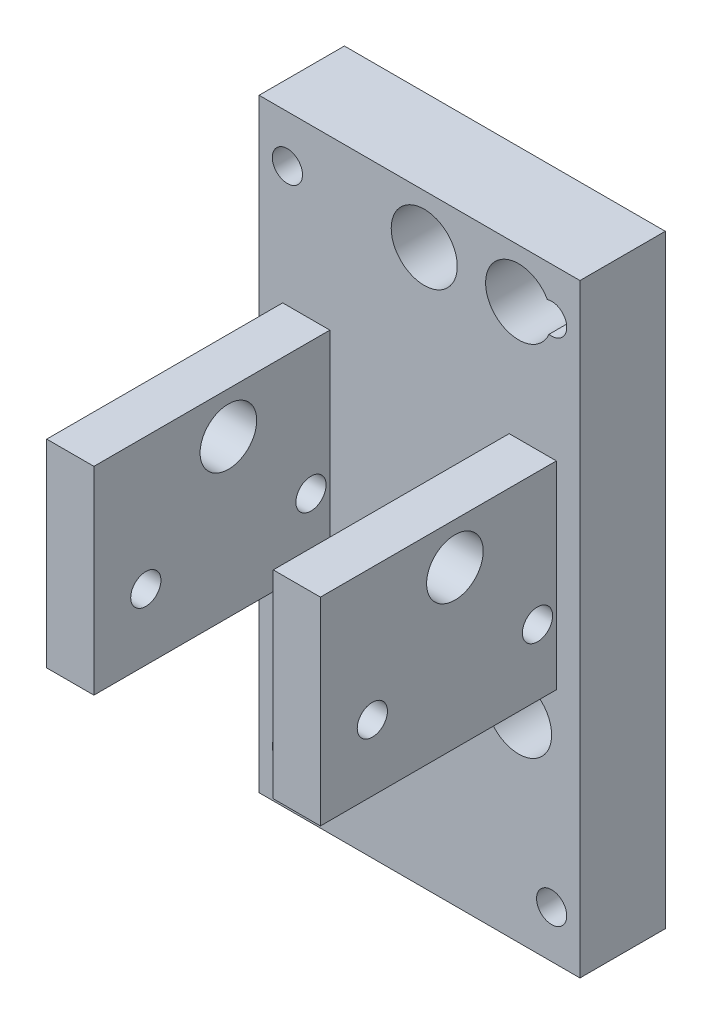
ISO-10303-21;
HEADER;
FILE_DESCRIPTION(('STEP AP214'),'2;1');
FILE_NAME('part.step','',(''),(''),'','','');
FILE_SCHEMA(('AUTOMOTIVE_DESIGN { 1 0 10303 214 1 1 1 1 }'));
ENDSEC;
DATA;
#1=APPLICATION_CONTEXT('core data for automotive mechanical design processes');
#2=APPLICATION_PROTOCOL_DEFINITION('international standard','automotive_design',2000,#1);
#3=PRODUCT_CONTEXT('',#1,'mechanical');
#4=PRODUCT('Part','Part','',(#3));
#5=PRODUCT_RELATED_PRODUCT_CATEGORY('part','',(#4));
#6=PRODUCT_DEFINITION_FORMATION('','',#4);
#7=PRODUCT_DEFINITION_CONTEXT('part definition',#1,'design');
#8=PRODUCT_DEFINITION('design','',#6,#7);
#9=PRODUCT_DEFINITION_SHAPE('','',#8);
#10=(LENGTH_UNIT() NAMED_UNIT(*) SI_UNIT(.MILLI.,.METRE.));
#11=(NAMED_UNIT(*) PLANE_ANGLE_UNIT() SI_UNIT($,.RADIAN.));
#12=(NAMED_UNIT(*) SI_UNIT($,.STERADIAN.) SOLID_ANGLE_UNIT());
#13=UNCERTAINTY_MEASURE_WITH_UNIT(LENGTH_MEASURE(1.E-05),#10,'distance_accuracy_value','');
#14=(GEOMETRIC_REPRESENTATION_CONTEXT(3) GLOBAL_UNCERTAINTY_ASSIGNED_CONTEXT((#13)) GLOBAL_UNIT_ASSIGNED_CONTEXT((#10,
#11,#12)) REPRESENTATION_CONTEXT('',''));
#15=CARTESIAN_POINT('',(0.,0.,0.));
#16=DIRECTION('',(0.,0.,1.));
#17=DIRECTION('',(1.,0.,0.));
#18=AXIS2_PLACEMENT_3D('',#15,#16,#17);
#19=CARTESIAN_POINT('',(0.,0.,9.04));
#20=DIRECTION('',(0.,0.,-1.));
#21=DIRECTION('',(-1.,0.,0.));
#22=AXIS2_PLACEMENT_3D('',#19,#20,#21);
#23=PLANE('',#22);
#24=CARTESIAN_POINT('',(0.499999999999997,-11.2,9.04));
#25=DIRECTION('',(0.,0.,-1.));
#26=DIRECTION('',(-1.,0.,0.));
#27=AXIS2_PLACEMENT_3D('',#24,#25,#26);
#28=CIRCLE('',#27,3.5);
#29=CARTESIAN_POINT('',(-3.,-11.2,9.04));
#30=VERTEX_POINT('',#29);
#31=EDGE_CURVE('E531',#30,#30,#28,.T.);
#32=ORIENTED_EDGE('',*,*,#31,.T.);
#33=EDGE_LOOP('',(#32));
#34=FACE_BOUND('',#33,.T.);
#35=CARTESIAN_POINT('',(10.5,-11.2,9.04));
#36=DIRECTION('',(0.,0.,-1.));
#37=DIRECTION('',(-1.,0.,0.));
#38=AXIS2_PLACEMENT_3D('',#35,#36,#37);
#39=CIRCLE('',#38,3.5);
#40=CARTESIAN_POINT('',(7.,-11.2,9.04));
#41=VERTEX_POINT('',#40);
#42=EDGE_CURVE('E533',#41,#41,#39,.T.);
#43=ORIENTED_EDGE('',*,*,#42,.T.);
#44=EDGE_LOOP('',(#43));
#45=FACE_BOUND('',#44,.T.);
#46=CARTESIAN_POINT('',(0.499999999999997,26.8,9.04));
#47=DIRECTION('',(0.,0.,-1.));
#48=DIRECTION('',(-1.,0.,0.));
#49=AXIS2_PLACEMENT_3D('',#46,#47,#48);
#50=CIRCLE('',#49,3.5);
#51=CARTESIAN_POINT('',(-3.,26.8,9.04));
#52=VERTEX_POINT('',#51);
#53=EDGE_CURVE('E538',#52,#52,#50,.T.);
#54=ORIENTED_EDGE('',*,*,#53,.T.);
#55=EDGE_LOOP('',(#54));
#56=FACE_BOUND('',#55,.T.);
#57=CARTESIAN_POINT('',(-14.,27.,9.04));
#58=DIRECTION('',(0.,0.,1.));
#59=DIRECTION('',(-1.,0.,0.));
#60=AXIS2_PLACEMENT_3D('',#57,#58,#59);
#61=CIRCLE('',#60,1.6);
#62=CARTESIAN_POINT('',(-15.6,27.,9.04));
#63=VERTEX_POINT('',#62);
#64=EDGE_CURVE('E542',#63,#63,#61,.T.);
#65=ORIENTED_EDGE('',*,*,#64,.F.);
#66=EDGE_LOOP('',(#65));
#67=FACE_BOUND('',#66,.T.);
#68=CARTESIAN_POINT('',(14.,-27.,9.04));
#69=DIRECTION('',(0.,0.,1.));
#70=DIRECTION('',(-1.,0.,0.));
#71=AXIS2_PLACEMENT_3D('',#68,#69,#70);
#72=CIRCLE('',#71,1.6);
#73=CARTESIAN_POINT('',(12.4,-27.,9.04));
#74=VERTEX_POINT('',#73);
#75=EDGE_CURVE('E535',#74,#74,#72,.T.);
#76=ORIENTED_EDGE('',*,*,#75,.F.);
#77=EDGE_LOOP('',(#76));
#78=FACE_BOUND('',#77,.T.);
#79=CARTESIAN_POINT('',(14.,27.,9.04));
#80=DIRECTION('',(0.,0.,1.));
#81=DIRECTION('',(1.,0.,0.));
#82=AXIS2_PLACEMENT_3D('',#79,#80,#81);
#83=CIRCLE('',#82,1.6);
#84=CARTESIAN_POINT('',(13.7185745984634,25.4249445268912,9.04));
#85=VERTEX_POINT('',#84);
#86=CARTESIAN_POINT('',(13.5409860199256,28.5327446513024,9.04));
#87=VERTEX_POINT('',#86);
#88=EDGE_CURVE('E532',#85,#87,#83,.T.);
#89=ORIENTED_EDGE('',*,*,#88,.F.);
#90=CARTESIAN_POINT('',(10.5,26.8,9.04));
#91=DIRECTION('',(0.,0.,-1.));
#92=DIRECTION('',(-1.,0.,0.));
#93=AXIS2_PLACEMENT_3D('',#90,#91,#92);
#94=CIRCLE('',#93,3.5);
#95=EDGE_CURVE('E132',#85,#87,#94,.T.);
#96=ORIENTED_EDGE('',*,*,#95,.T.);
#97=EDGE_LOOP('',(#89,#96));
#98=FACE_BOUND('',#97,.T.);
#99=CARTESIAN_POINT('',(-14.,-27.,9.04));
#100=DIRECTION('',(0.,0.,1.));
#101=DIRECTION('',(1.,0.,0.));
#102=AXIS2_PLACEMENT_3D('',#99,#100,#101);
#103=CIRCLE('',#102,1.6);
#104=CARTESIAN_POINT('',(-12.4,-27.,9.04));
#105=VERTEX_POINT('',#104);
#106=EDGE_CURVE('E153',#105,#105,#103,.T.);
#107=ORIENTED_EDGE('',*,*,#106,.F.);
#108=EDGE_LOOP('',(#107));
#109=FACE_BOUND('',#108,.T.);
#110=DIRECTION('',(1.,0.,0.));
#111=VECTOR('',#110,1.);
#112=CARTESIAN_POINT('',(14.5,-6.8,9.04));
#113=LINE('',#112,#111);
#114=CARTESIAN_POINT('',(9.5,-6.8,9.04));
#115=VERTEX_POINT('',#114);
#116=CARTESIAN_POINT('',(14.5,-6.8,9.04));
#117=VERTEX_POINT('',#116);
#118=EDGE_CURVE('E229',#115,#117,#113,.T.);
#119=ORIENTED_EDGE('',*,*,#118,.F.);
#120=DIRECTION('',(0.,-1.,0.));
#121=VECTOR('',#120,1.);
#122=CARTESIAN_POINT('',(9.5,14.2,9.04));
#123=LINE('',#122,#121);
#124=CARTESIAN_POINT('',(9.5,14.2,9.04));
#125=VERTEX_POINT('',#124);
#126=EDGE_CURVE('E234',#125,#115,#123,.T.);
#127=ORIENTED_EDGE('',*,*,#126,.F.);
#128=DIRECTION('',(-1.,0.,0.));
#129=VECTOR('',#128,1.);
#130=CARTESIAN_POINT('',(9.5,14.2,9.04));
#131=LINE('',#130,#129);
#132=CARTESIAN_POINT('',(14.5,14.2,9.04));
#133=VERTEX_POINT('',#132);
#134=EDGE_CURVE('E246',#133,#125,#131,.T.);
#135=ORIENTED_EDGE('',*,*,#134,.F.);
#136=DIRECTION('',(0.,1.,0.));
#137=VECTOR('',#136,1.);
#138=CARTESIAN_POINT('',(14.5,14.2,9.04));
#139=LINE('',#138,#137);
#140=EDGE_CURVE('E243',#117,#133,#139,.T.);
#141=ORIENTED_EDGE('',*,*,#140,.F.);
#142=EDGE_LOOP('',(#119,#127,#135,#141));
#143=FACE_BOUND('',#142,.T.);
#144=DIRECTION('',(0.,1.,0.));
#145=VECTOR('',#144,1.);
#146=CARTESIAN_POINT('',(17.,-32.,9.04));
#147=LINE('',#146,#145);
#148=CARTESIAN_POINT('',(17.,-32.,9.04));
#149=VERTEX_POINT('',#148);
#150=CARTESIAN_POINT('',(17.,32.,9.04));
#151=VERTEX_POINT('',#150);
#152=EDGE_CURVE('E263',#149,#151,#147,.T.);
#153=ORIENTED_EDGE('',*,*,#152,.T.);
#154=DIRECTION('',(-1.,0.,0.));
#155=VECTOR('',#154,1.);
#156=CARTESIAN_POINT('',(-17.,32.,9.04));
#157=LINE('',#156,#155);
#158=CARTESIAN_POINT('',(-17.,32.,9.04));
#159=VERTEX_POINT('',#158);
#160=EDGE_CURVE('E266',#151,#159,#157,.T.);
#161=ORIENTED_EDGE('',*,*,#160,.T.);
#162=DIRECTION('',(0.,-1.,0.));
#163=VECTOR('',#162,1.);
#164=CARTESIAN_POINT('',(-17.,-32.,9.04));
#165=LINE('',#164,#163);
#166=CARTESIAN_POINT('',(-17.,-32.,9.04));
#167=VERTEX_POINT('',#166);
#168=EDGE_CURVE('E269',#159,#167,#165,.T.);
#169=ORIENTED_EDGE('',*,*,#168,.T.);
#170=DIRECTION('',(1.,0.,0.));
#171=VECTOR('',#170,1.);
#172=CARTESIAN_POINT('',(-17.,-32.,9.04));
#173=LINE('',#172,#171);
#174=EDGE_CURVE('E271',#167,#149,#173,.T.);
#175=ORIENTED_EDGE('',*,*,#174,.T.);
#176=EDGE_LOOP('',(#153,#161,#169,#175));
#177=FACE_BOUND('',#176,.T.);
#178=DIRECTION('',(0.,1.,0.));
#179=VECTOR('',#178,1.);
#180=CARTESIAN_POINT('',(-9.5,14.2,9.04));
#181=LINE('',#180,#179);
#182=CARTESIAN_POINT('',(-9.50000000000001,-6.8,9.04));
#183=VERTEX_POINT('',#182);
#184=CARTESIAN_POINT('',(-9.5,14.2,9.04));
#185=VERTEX_POINT('',#184);
#186=EDGE_CURVE('E199',#183,#185,#181,.T.);
#187=ORIENTED_EDGE('',*,*,#186,.F.);
#188=DIRECTION('',(1.,0.,0.));
#189=VECTOR('',#188,1.);
#190=CARTESIAN_POINT('',(-14.5,-6.8,9.04));
#191=LINE('',#190,#189);
#192=CARTESIAN_POINT('',(-14.5,-6.8,9.04));
#193=VERTEX_POINT('',#192);
#194=EDGE_CURVE('E204',#193,#183,#191,.T.);
#195=ORIENTED_EDGE('',*,*,#194,.F.);
#196=DIRECTION('',(0.,-1.,0.));
#197=VECTOR('',#196,1.);
#198=CARTESIAN_POINT('',(-14.5,14.2,9.04));
#199=LINE('',#198,#197);
#200=CARTESIAN_POINT('',(-14.5,14.2,9.04));
#201=VERTEX_POINT('',#200);
#202=EDGE_CURVE('E214',#201,#193,#199,.T.);
#203=ORIENTED_EDGE('',*,*,#202,.F.);
#204=DIRECTION('',(-1.,0.,0.));
#205=VECTOR('',#204,1.);
#206=CARTESIAN_POINT('',(-9.5,14.2,9.04));
#207=LINE('',#206,#205);
#208=EDGE_CURVE('E55',#185,#201,#207,.T.);
#209=ORIENTED_EDGE('',*,*,#208,.F.);
#210=EDGE_LOOP('',(#187,#195,#203,#209));
#211=FACE_BOUND('',#210,.T.);
#212=ADVANCED_FACE('F32',(#34,#45,#56,#67,#78,#98,#109,#143,#177,#211),#23,.F.);
#213=CARTESIAN_POINT('',(17.,-32.,9.04));
#214=DIRECTION('',(-1.,0.,0.));
#215=DIRECTION('',(0.,0.,1.));
#216=AXIS2_PLACEMENT_3D('',#213,#214,#215);
#217=PLANE('',#216);
#218=DIRECTION('',(0.,1.,0.));
#219=VECTOR('',#218,1.);
#220=CARTESIAN_POINT('',(17.,-32.,0.));
#221=LINE('',#220,#219);
#222=CARTESIAN_POINT('',(17.,-32.,0.));
#223=VERTEX_POINT('',#222);
#224=CARTESIAN_POINT('',(17.,32.,0.));
#225=VERTEX_POINT('',#224);
#226=EDGE_CURVE('E262',#223,#225,#221,.T.);
#227=ORIENTED_EDGE('',*,*,#226,.T.);
#228=DIRECTION('',(0.,0.,-1.));
#229=VECTOR('',#228,1.);
#230=CARTESIAN_POINT('',(17.,32.,9.04));
#231=LINE('',#230,#229);
#232=EDGE_CURVE('E159',#151,#225,#231,.T.);
#233=ORIENTED_EDGE('',*,*,#232,.F.);
#234=ORIENTED_EDGE('',*,*,#152,.F.);
#235=DIRECTION('',(0.,0.,-1.));
#236=VECTOR('',#235,1.);
#237=CARTESIAN_POINT('',(17.,-32.,9.04));
#238=LINE('',#237,#236);
#239=EDGE_CURVE('E273',#149,#223,#238,.T.);
#240=ORIENTED_EDGE('',*,*,#239,.T.);
#241=EDGE_LOOP('',(#227,#233,#234,#240));
#242=FACE_BOUND('',#241,.T.);
#243=ADVANCED_FACE('F34',(#242),#217,.F.);
#244=CARTESIAN_POINT('',(-17.,32.,9.04));
#245=DIRECTION('',(0.,-1.,0.));
#246=DIRECTION('',(0.,0.,-1.));
#247=AXIS2_PLACEMENT_3D('',#244,#245,#246);
#248=PLANE('',#247);
#249=DIRECTION('',(-1.,0.,0.));
#250=VECTOR('',#249,1.);
#251=CARTESIAN_POINT('',(-17.,32.,0.));
#252=LINE('',#251,#250);
#253=CARTESIAN_POINT('',(-17.,32.,0.));
#254=VERTEX_POINT('',#253);
#255=EDGE_CURVE('E275',#225,#254,#252,.T.);
#256=ORIENTED_EDGE('',*,*,#255,.T.);
#257=DIRECTION('',(0.,0.,-1.));
#258=VECTOR('',#257,1.);
#259=CARTESIAN_POINT('',(-17.,32.,9.04));
#260=LINE('',#259,#258);
#261=EDGE_CURVE('E161',#159,#254,#260,.T.);
#262=ORIENTED_EDGE('',*,*,#261,.F.);
#263=ORIENTED_EDGE('',*,*,#160,.F.);
#264=ORIENTED_EDGE('',*,*,#232,.T.);
#265=EDGE_LOOP('',(#256,#262,#263,#264));
#266=FACE_BOUND('',#265,.T.);
#267=ADVANCED_FACE('F298',(#266),#248,.F.);
#268=CARTESIAN_POINT('',(-17.,-32.,9.04));
#269=DIRECTION('',(1.,0.,0.));
#270=DIRECTION('',(0.,0.,-1.));
#271=AXIS2_PLACEMENT_3D('',#268,#269,#270);
#272=PLANE('',#271);
#273=DIRECTION('',(0.,-1.,0.));
#274=VECTOR('',#273,1.);
#275=CARTESIAN_POINT('',(-17.,-32.,0.));
#276=LINE('',#275,#274);
#277=CARTESIAN_POINT('',(-17.,-32.,0.));
#278=VERTEX_POINT('',#277);
#279=EDGE_CURVE('E277',#254,#278,#276,.T.);
#280=ORIENTED_EDGE('',*,*,#279,.T.);
#281=DIRECTION('',(0.,0.,-1.));
#282=VECTOR('',#281,1.);
#283=CARTESIAN_POINT('',(-17.,-32.,9.04));
#284=LINE('',#283,#282);
#285=EDGE_CURVE('E167',#167,#278,#284,.T.);
#286=ORIENTED_EDGE('',*,*,#285,.F.);
#287=ORIENTED_EDGE('',*,*,#168,.F.);
#288=ORIENTED_EDGE('',*,*,#261,.T.);
#289=EDGE_LOOP('',(#280,#286,#287,#288));
#290=FACE_BOUND('',#289,.T.);
#291=ADVANCED_FACE('F297',(#290),#272,.F.);
#292=CARTESIAN_POINT('',(-17.,-32.,9.04));
#293=DIRECTION('',(0.,1.,0.));
#294=DIRECTION('',(0.,0.,1.));
#295=AXIS2_PLACEMENT_3D('',#292,#293,#294);
#296=PLANE('',#295);
#297=DIRECTION('',(1.,0.,0.));
#298=VECTOR('',#297,1.);
#299=CARTESIAN_POINT('',(-17.,-32.,0.));
#300=LINE('',#299,#298);
#301=EDGE_CURVE('E267',#278,#223,#300,.T.);
#302=ORIENTED_EDGE('',*,*,#301,.T.);
#303=ORIENTED_EDGE('',*,*,#239,.F.);
#304=ORIENTED_EDGE('',*,*,#174,.F.);
#305=ORIENTED_EDGE('',*,*,#285,.T.);
#306=EDGE_LOOP('',(#302,#303,#304,#305));
#307=FACE_BOUND('',#306,.T.);
#308=ADVANCED_FACE('F286',(#307),#296,.F.);
#309=CARTESIAN_POINT('',(0.,0.,0.));
#310=DIRECTION('',(0.,0.,-1.));
#311=DIRECTION('',(-1.,0.,0.));
#312=AXIS2_PLACEMENT_3D('',#309,#310,#311);
#313=PLANE('',#312);
#314=CARTESIAN_POINT('',(10.5,26.8,0.));
#315=DIRECTION('',(0.,0.,-1.));
#316=DIRECTION('',(1.,0.,0.));
#317=AXIS2_PLACEMENT_3D('',#314,#315,#316);
#318=CIRCLE('',#317,3.5);
#319=CARTESIAN_POINT('',(13.7185745984634,25.4249445268912,0.));
#320=VERTEX_POINT('',#319);
#321=CARTESIAN_POINT('',(13.5409860199256,28.5327446513024,0.));
#322=VERTEX_POINT('',#321);
#323=EDGE_CURVE('E47',#320,#322,#318,.T.);
#324=ORIENTED_EDGE('',*,*,#323,.F.);
#325=CARTESIAN_POINT('',(14.,27.,0.));
#326=DIRECTION('',(0.,0.,-1.));
#327=DIRECTION('',(-1.,0.,0.));
#328=AXIS2_PLACEMENT_3D('',#325,#326,#327);
#329=CIRCLE('',#328,1.6);
#330=EDGE_CURVE('E141',#322,#320,#329,.T.);
#331=ORIENTED_EDGE('',*,*,#330,.F.);
#332=EDGE_LOOP('',(#324,#331));
#333=FACE_BOUND('',#332,.T.);
#334=CARTESIAN_POINT('',(0.499999999999997,-11.2,0.));
#335=DIRECTION('',(0.,0.,-1.));
#336=DIRECTION('',(1.,0.,0.));
#337=AXIS2_PLACEMENT_3D('',#334,#335,#336);
#338=CIRCLE('',#337,3.5);
#339=CARTESIAN_POINT('',(4.,-11.2,0.));
#340=VERTEX_POINT('',#339);
#341=EDGE_CURVE('E143',#340,#340,#338,.T.);
#342=ORIENTED_EDGE('',*,*,#341,.F.);
#343=EDGE_LOOP('',(#342));
#344=FACE_BOUND('',#343,.T.);
#345=CARTESIAN_POINT('',(10.5,-11.2,0.));
#346=DIRECTION('',(0.,0.,-1.));
#347=DIRECTION('',(-1.,0.,0.));
#348=AXIS2_PLACEMENT_3D('',#345,#346,#347);
#349=CIRCLE('',#348,3.5);
#350=CARTESIAN_POINT('',(7.,-11.2,0.));
#351=VERTEX_POINT('',#350);
#352=EDGE_CURVE('E603',#351,#351,#349,.T.);
#353=ORIENTED_EDGE('',*,*,#352,.F.);
#354=EDGE_LOOP('',(#353));
#355=FACE_BOUND('',#354,.T.);
#356=CARTESIAN_POINT('',(0.499999999999997,26.8,0.));
#357=DIRECTION('',(0.,0.,-1.));
#358=DIRECTION('',(-1.,0.,0.));
#359=AXIS2_PLACEMENT_3D('',#356,#357,#358);
#360=CIRCLE('',#359,3.5);
#361=CARTESIAN_POINT('',(-3.,26.8,0.));
#362=VERTEX_POINT('',#361);
#363=EDGE_CURVE('E142',#362,#362,#360,.T.);
#364=ORIENTED_EDGE('',*,*,#363,.F.);
#365=EDGE_LOOP('',(#364));
#366=FACE_BOUND('',#365,.T.);
#367=CARTESIAN_POINT('',(-14.,27.,0.));
#368=DIRECTION('',(0.,0.,-1.));
#369=DIRECTION('',(-1.,0.,0.));
#370=AXIS2_PLACEMENT_3D('',#367,#368,#369);
#371=CIRCLE('',#370,1.6);
#372=CARTESIAN_POINT('',(-15.6,27.,0.));
#373=VERTEX_POINT('',#372);
#374=EDGE_CURVE('E150',#373,#373,#371,.T.);
#375=ORIENTED_EDGE('',*,*,#374,.F.);
#376=EDGE_LOOP('',(#375));
#377=FACE_BOUND('',#376,.T.);
#378=CARTESIAN_POINT('',(14.,-27.,0.));
#379=DIRECTION('',(0.,0.,-1.));
#380=DIRECTION('',(-1.,0.,0.));
#381=AXIS2_PLACEMENT_3D('',#378,#379,#380);
#382=CIRCLE('',#381,1.6);
#383=CARTESIAN_POINT('',(12.4,-27.,0.));
#384=VERTEX_POINT('',#383);
#385=EDGE_CURVE('E146',#384,#384,#382,.T.);
#386=ORIENTED_EDGE('',*,*,#385,.F.);
#387=EDGE_LOOP('',(#386));
#388=FACE_BOUND('',#387,.T.);
#389=CARTESIAN_POINT('',(-14.,-27.,0.));
#390=DIRECTION('',(0.,0.,-1.));
#391=DIRECTION('',(-1.,0.,0.));
#392=AXIS2_PLACEMENT_3D('',#389,#390,#391);
#393=CIRCLE('',#392,1.6);
#394=CARTESIAN_POINT('',(-15.6,-27.,0.));
#395=VERTEX_POINT('',#394);
#396=EDGE_CURVE('E147',#395,#395,#393,.T.);
#397=ORIENTED_EDGE('',*,*,#396,.F.);
#398=EDGE_LOOP('',(#397));
#399=FACE_BOUND('',#398,.T.);
#400=ORIENTED_EDGE('',*,*,#226,.F.);
#401=ORIENTED_EDGE('',*,*,#301,.F.);
#402=ORIENTED_EDGE('',*,*,#279,.F.);
#403=ORIENTED_EDGE('',*,*,#255,.F.);
#404=EDGE_LOOP('',(#400,#401,#402,#403));
#405=FACE_BOUND('',#404,.T.);
#406=ADVANCED_FACE('F139',(#333,#344,#355,#366,#377,#388,#399,#405),#313,.T.);
#407=CARTESIAN_POINT('',(14.5,-6.8,34.04));
#408=DIRECTION('',(0.,1.,0.));
#409=DIRECTION('',(-1.,0.,0.));
#410=AXIS2_PLACEMENT_3D('',#407,#408,#409);
#411=PLANE('',#410);
#412=ORIENTED_EDGE('',*,*,#118,.T.);
#413=DIRECTION('',(0.,0.,-1.));
#414=VECTOR('',#413,1.);
#415=CARTESIAN_POINT('',(14.5,-6.8,34.04));
#416=LINE('',#415,#414);
#417=CARTESIAN_POINT('',(14.5,-6.8,34.04));
#418=VERTEX_POINT('',#417);
#419=EDGE_CURVE('E259',#418,#117,#416,.T.);
#420=ORIENTED_EDGE('',*,*,#419,.F.);
#421=DIRECTION('',(1.,0.,0.));
#422=VECTOR('',#421,1.);
#423=CARTESIAN_POINT('',(14.5,-6.8,34.04));
#424=LINE('',#423,#422);
#425=CARTESIAN_POINT('',(9.5,-6.8,34.04));
#426=VERTEX_POINT('',#425);
#427=EDGE_CURVE('E230',#426,#418,#424,.T.);
#428=ORIENTED_EDGE('',*,*,#427,.F.);
#429=DIRECTION('',(0.,0.,-1.));
#430=VECTOR('',#429,1.);
#431=CARTESIAN_POINT('',(9.5,-6.8,34.04));
#432=LINE('',#431,#430);
#433=EDGE_CURVE('E240',#426,#115,#432,.T.);
#434=ORIENTED_EDGE('',*,*,#433,.T.);
#435=EDGE_LOOP('',(#412,#420,#428,#434));
#436=FACE_BOUND('',#435,.T.);
#437=ADVANCED_FACE('F316',(#436),#411,.F.);
#438=CARTESIAN_POINT('',(14.5,14.2,34.04));
#439=DIRECTION('',(-1.,0.,0.));
#440=DIRECTION('',(0.,-1.,0.));
#441=AXIS2_PLACEMENT_3D('',#438,#439,#440);
#442=PLANE('',#441);
#443=CARTESIAN_POINT('',(14.5,0.2,28.54));
#444=DIRECTION('',(1.,0.,0.));
#445=DIRECTION('',(0.,1.,0.));
#446=AXIS2_PLACEMENT_3D('',#443,#444,#445);
#447=CIRCLE('',#446,1.6);
#448=CARTESIAN_POINT('',(14.5,1.8,28.54));
#449=VERTEX_POINT('',#448);
#450=EDGE_CURVE('E175',#449,#449,#447,.T.);
#451=ORIENTED_EDGE('',*,*,#450,.F.);
#452=EDGE_LOOP('',(#451));
#453=FACE_BOUND('',#452,.T.);
#454=CARTESIAN_POINT('',(14.5,0.2,11.04));
#455=DIRECTION('',(1.,0.,0.));
#456=DIRECTION('',(0.,1.,0.));
#457=AXIS2_PLACEMENT_3D('',#454,#455,#456);
#458=CIRCLE('',#457,1.6);
#459=CARTESIAN_POINT('',(14.5,1.8,11.04));
#460=VERTEX_POINT('',#459);
#461=EDGE_CURVE('E551',#460,#460,#458,.T.);
#462=ORIENTED_EDGE('',*,*,#461,.F.);
#463=EDGE_LOOP('',(#462));
#464=FACE_BOUND('',#463,.T.);
#465=CARTESIAN_POINT('',(14.5,9.8,19.79));
#466=DIRECTION('',(1.,0.,0.));
#467=DIRECTION('',(0.,1.,0.));
#468=AXIS2_PLACEMENT_3D('',#465,#466,#467);
#469=CIRCLE('',#468,3.);
#470=CARTESIAN_POINT('',(14.5,12.8,19.79));
#471=VERTEX_POINT('',#470);
#472=EDGE_CURVE('E158',#471,#471,#469,.T.);
#473=ORIENTED_EDGE('',*,*,#472,.F.);
#474=EDGE_LOOP('',(#473));
#475=FACE_BOUND('',#474,.T.);
#476=ORIENTED_EDGE('',*,*,#140,.T.);
#477=DIRECTION('',(0.,0.,-1.));
#478=VECTOR('',#477,1.);
#479=CARTESIAN_POINT('',(14.5,14.2,34.04));
#480=LINE('',#479,#478);
#481=CARTESIAN_POINT('',(14.5,14.2,34.04));
#482=VERTEX_POINT('',#481);
#483=EDGE_CURVE('E256',#482,#133,#480,.T.);
#484=ORIENTED_EDGE('',*,*,#483,.F.);
#485=DIRECTION('',(0.,1.,0.));
#486=VECTOR('',#485,1.);
#487=CARTESIAN_POINT('',(14.5,14.2,34.04));
#488=LINE('',#487,#486);
#489=EDGE_CURVE('E233',#418,#482,#488,.T.);
#490=ORIENTED_EDGE('',*,*,#489,.F.);
#491=ORIENTED_EDGE('',*,*,#419,.T.);
#492=EDGE_LOOP('',(#476,#484,#490,#491));
#493=FACE_BOUND('',#492,.T.);
#494=ADVANCED_FACE('F338',(#453,#464,#475,#493),#442,.F.);
#495=CARTESIAN_POINT('',(9.5,14.2,34.04));
#496=DIRECTION('',(0.,-1.,0.));
#497=DIRECTION('',(1.,0.,0.));
#498=AXIS2_PLACEMENT_3D('',#495,#496,#497);
#499=PLANE('',#498);
#500=ORIENTED_EDGE('',*,*,#134,.T.);
#501=DIRECTION('',(0.,0.,-1.));
#502=VECTOR('',#501,1.);
#503=CARTESIAN_POINT('',(9.5,14.2,34.04));
#504=LINE('',#503,#502);
#505=CARTESIAN_POINT('',(9.5,14.2,34.04));
#506=VERTEX_POINT('',#505);
#507=EDGE_CURVE('E253',#506,#125,#504,.T.);
#508=ORIENTED_EDGE('',*,*,#507,.F.);
#509=DIRECTION('',(-1.,0.,0.));
#510=VECTOR('',#509,1.);
#511=CARTESIAN_POINT('',(9.5,14.2,34.04));
#512=LINE('',#511,#510);
#513=EDGE_CURVE('E236',#482,#506,#512,.T.);
#514=ORIENTED_EDGE('',*,*,#513,.F.);
#515=ORIENTED_EDGE('',*,*,#483,.T.);
#516=EDGE_LOOP('',(#500,#508,#514,#515));
#517=FACE_BOUND('',#516,.T.);
#518=ADVANCED_FACE('F346',(#517),#499,.F.);
#519=CARTESIAN_POINT('',(9.5,14.2,34.04));
#520=DIRECTION('',(1.,0.,0.));
#521=DIRECTION('',(0.,1.,0.));
#522=AXIS2_PLACEMENT_3D('',#519,#520,#521);
#523=PLANE('',#522);
#524=CARTESIAN_POINT('',(9.5,0.2,28.54));
#525=DIRECTION('',(1.,0.,0.));
#526=DIRECTION('',(0.,1.,0.));
#527=AXIS2_PLACEMENT_3D('',#524,#525,#526);
#528=CIRCLE('',#527,1.6);
#529=CARTESIAN_POINT('',(9.5,1.8,28.54));
#530=VERTEX_POINT('',#529);
#531=EDGE_CURVE('E187',#530,#530,#528,.T.);
#532=ORIENTED_EDGE('',*,*,#531,.T.);
#533=EDGE_LOOP('',(#532));
#534=FACE_BOUND('',#533,.T.);
#535=CARTESIAN_POINT('',(9.5,0.2,11.04));
#536=DIRECTION('',(1.,0.,0.));
#537=DIRECTION('',(0.,1.,0.));
#538=AXIS2_PLACEMENT_3D('',#535,#536,#537);
#539=CIRCLE('',#538,1.6);
#540=CARTESIAN_POINT('',(9.5,1.8,11.04));
#541=VERTEX_POINT('',#540);
#542=EDGE_CURVE('E183',#541,#541,#539,.T.);
#543=ORIENTED_EDGE('',*,*,#542,.T.);
#544=EDGE_LOOP('',(#543));
#545=FACE_BOUND('',#544,.T.);
#546=CARTESIAN_POINT('',(9.5,9.8,19.79));
#547=DIRECTION('',(1.,0.,0.));
#548=DIRECTION('',(0.,1.,0.));
#549=AXIS2_PLACEMENT_3D('',#546,#547,#548);
#550=CIRCLE('',#549,3.);
#551=CARTESIAN_POINT('',(9.5,12.8,19.79));
#552=VERTEX_POINT('',#551);
#553=EDGE_CURVE('E179',#552,#552,#550,.T.);
#554=ORIENTED_EDGE('',*,*,#553,.T.);
#555=EDGE_LOOP('',(#554));
#556=FACE_BOUND('',#555,.T.);
#557=ORIENTED_EDGE('',*,*,#126,.T.);
#558=ORIENTED_EDGE('',*,*,#433,.F.);
#559=DIRECTION('',(0.,-1.,0.));
#560=VECTOR('',#559,1.);
#561=CARTESIAN_POINT('',(9.5,14.2,34.04));
#562=LINE('',#561,#560);
#563=EDGE_CURVE('E238',#506,#426,#562,.T.);
#564=ORIENTED_EDGE('',*,*,#563,.F.);
#565=ORIENTED_EDGE('',*,*,#507,.T.);
#566=EDGE_LOOP('',(#557,#558,#564,#565));
#567=FACE_BOUND('',#566,.T.);
#568=ADVANCED_FACE('F354',(#534,#545,#556,#567),#523,.F.);
#569=CARTESIAN_POINT('',(0.,0.,34.04));
#570=DIRECTION('',(0.,0.,1.));
#571=DIRECTION('',(1.,0.,0.));
#572=AXIS2_PLACEMENT_3D('',#569,#570,#571);
#573=PLANE('',#572);
#574=ORIENTED_EDGE('',*,*,#427,.T.);
#575=ORIENTED_EDGE('',*,*,#489,.T.);
#576=ORIENTED_EDGE('',*,*,#513,.T.);
#577=ORIENTED_EDGE('',*,*,#563,.T.);
#578=EDGE_LOOP('',(#574,#575,#576,#577));
#579=FACE_BOUND('',#578,.T.);
#580=ADVANCED_FACE('F362',(#579),#573,.T.);
#581=CARTESIAN_POINT('',(-9.5,14.2,34.04));
#582=DIRECTION('',(-1.,0.,0.));
#583=DIRECTION('',(0.,-1.,0.));
#584=AXIS2_PLACEMENT_3D('',#581,#582,#583);
#585=PLANE('',#584);
#586=CARTESIAN_POINT('',(-9.50000000000001,0.199999999999998,28.54));
#587=DIRECTION('',(-1.,0.,0.));
#588=DIRECTION('',(0.,-1.,0.));
#589=AXIS2_PLACEMENT_3D('',#586,#587,#588);
#590=CIRCLE('',#589,1.6);
#591=CARTESIAN_POINT('',(-9.50000000000001,-1.4,28.54));
#592=VERTEX_POINT('',#591);
#593=EDGE_CURVE('E182',#592,#592,#590,.T.);
#594=ORIENTED_EDGE('',*,*,#593,.T.);
#595=EDGE_LOOP('',(#594));
#596=FACE_BOUND('',#595,.T.);
#597=CARTESIAN_POINT('',(-9.50000000000001,0.199999999999998,11.04));
#598=DIRECTION('',(-1.,0.,0.));
#599=DIRECTION('',(0.,-1.,0.));
#600=AXIS2_PLACEMENT_3D('',#597,#598,#599);
#601=CIRCLE('',#600,1.6);
#602=CARTESIAN_POINT('',(-9.50000000000001,-1.4,11.04));
#603=VERTEX_POINT('',#602);
#604=EDGE_CURVE('E178',#603,#603,#601,.T.);
#605=ORIENTED_EDGE('',*,*,#604,.T.);
#606=EDGE_LOOP('',(#605));
#607=FACE_BOUND('',#606,.T.);
#608=CARTESIAN_POINT('',(-9.5,9.8,19.79));
#609=DIRECTION('',(-1.,0.,0.));
#610=DIRECTION('',(0.,-1.,0.));
#611=AXIS2_PLACEMENT_3D('',#608,#609,#610);
#612=CIRCLE('',#611,3.);
#613=CARTESIAN_POINT('',(-9.5,6.8,19.79));
#614=VERTEX_POINT('',#613);
#615=EDGE_CURVE('E174',#614,#614,#612,.T.);
#616=ORIENTED_EDGE('',*,*,#615,.T.);
#617=EDGE_LOOP('',(#616));
#618=FACE_BOUND('',#617,.T.);
#619=ORIENTED_EDGE('',*,*,#186,.T.);
#620=DIRECTION('',(0.,0.,-1.));
#621=VECTOR('',#620,1.);
#622=CARTESIAN_POINT('',(-9.5,14.2,34.04));
#623=LINE('',#622,#621);
#624=CARTESIAN_POINT('',(-9.5,14.2,34.04));
#625=VERTEX_POINT('',#624);
#626=EDGE_CURVE('E227',#625,#185,#623,.T.);
#627=ORIENTED_EDGE('',*,*,#626,.F.);
#628=DIRECTION('',(0.,1.,0.));
#629=VECTOR('',#628,1.);
#630=CARTESIAN_POINT('',(-9.5,14.2,34.04));
#631=LINE('',#630,#629);
#632=CARTESIAN_POINT('',(-9.50000000000001,-6.8,34.04));
#633=VERTEX_POINT('',#632);
#634=EDGE_CURVE('E200',#633,#625,#631,.T.);
#635=ORIENTED_EDGE('',*,*,#634,.F.);
#636=DIRECTION('',(0.,0.,-1.));
#637=VECTOR('',#636,1.);
#638=CARTESIAN_POINT('',(-9.50000000000001,-6.8,34.04));
#639=LINE('',#638,#637);
#640=EDGE_CURVE('E210',#633,#183,#639,.T.);
#641=ORIENTED_EDGE('',*,*,#640,.T.);
#642=EDGE_LOOP('',(#619,#627,#635,#641));
#643=FACE_BOUND('',#642,.T.);
#644=ADVANCED_FACE('F370',(#596,#607,#618,#643),#585,.F.);
#645=CARTESIAN_POINT('',(-9.5,14.2,34.04));
#646=DIRECTION('',(0.,-1.,0.));
#647=DIRECTION('',(1.,0.,0.));
#648=AXIS2_PLACEMENT_3D('',#645,#646,#647);
#649=PLANE('',#648);
#650=ORIENTED_EDGE('',*,*,#208,.T.);
#651=DIRECTION('',(0.,0.,-1.));
#652=VECTOR('',#651,1.);
#653=CARTESIAN_POINT('',(-14.5,14.2,34.04));
#654=LINE('',#653,#652);
#655=CARTESIAN_POINT('',(-14.5,14.2,34.04));
#656=VERTEX_POINT('',#655);
#657=EDGE_CURVE('E224',#656,#201,#654,.T.);
#658=ORIENTED_EDGE('',*,*,#657,.F.);
#659=DIRECTION('',(-1.,0.,0.));
#660=VECTOR('',#659,1.);
#661=CARTESIAN_POINT('',(-9.5,14.2,34.04));
#662=LINE('',#661,#660);
#663=EDGE_CURVE('E203',#625,#656,#662,.T.);
#664=ORIENTED_EDGE('',*,*,#663,.F.);
#665=ORIENTED_EDGE('',*,*,#626,.T.);
#666=EDGE_LOOP('',(#650,#658,#664,#665));
#667=FACE_BOUND('',#666,.T.);
#668=ADVANCED_FACE('F378',(#667),#649,.F.);
#669=CARTESIAN_POINT('',(-14.5,14.2,34.04));
#670=DIRECTION('',(1.,0.,0.));
#671=DIRECTION('',(0.,1.,0.));
#672=AXIS2_PLACEMENT_3D('',#669,#670,#671);
#673=PLANE('',#672);
#674=CARTESIAN_POINT('',(-14.5,0.199999999999998,28.54));
#675=DIRECTION('',(1.,0.,0.));
#676=DIRECTION('',(0.,1.,0.));
#677=AXIS2_PLACEMENT_3D('',#674,#675,#676);
#678=CIRCLE('',#677,1.6);
#679=CARTESIAN_POINT('',(-14.5,1.8,28.54));
#680=VERTEX_POINT('',#679);
#681=EDGE_CURVE('E180',#680,#680,#678,.T.);
#682=ORIENTED_EDGE('',*,*,#681,.T.);
#683=EDGE_LOOP('',(#682));
#684=FACE_BOUND('',#683,.T.);
#685=CARTESIAN_POINT('',(-14.5,0.199999999999998,11.04));
#686=DIRECTION('',(1.,0.,0.));
#687=DIRECTION('',(0.,1.,0.));
#688=AXIS2_PLACEMENT_3D('',#685,#686,#687);
#689=CIRCLE('',#688,1.6);
#690=CARTESIAN_POINT('',(-14.5,1.8,11.04));
#691=VERTEX_POINT('',#690);
#692=EDGE_CURVE('E176',#691,#691,#689,.T.);
#693=ORIENTED_EDGE('',*,*,#692,.T.);
#694=EDGE_LOOP('',(#693));
#695=FACE_BOUND('',#694,.T.);
#696=CARTESIAN_POINT('',(-14.5,9.8,19.79));
#697=DIRECTION('',(1.,0.,0.));
#698=DIRECTION('',(0.,1.,0.));
#699=AXIS2_PLACEMENT_3D('',#696,#697,#698);
#700=CIRCLE('',#699,3.);
#701=CARTESIAN_POINT('',(-14.5,12.8,19.79));
#702=VERTEX_POINT('',#701);
#703=EDGE_CURVE('E171',#702,#702,#700,.T.);
#704=ORIENTED_EDGE('',*,*,#703,.T.);
#705=EDGE_LOOP('',(#704));
#706=FACE_BOUND('',#705,.T.);
#707=ORIENTED_EDGE('',*,*,#202,.T.);
#708=DIRECTION('',(0.,0.,-1.));
#709=VECTOR('',#708,1.);
#710=CARTESIAN_POINT('',(-14.5,-6.8,34.04));
#711=LINE('',#710,#709);
#712=CARTESIAN_POINT('',(-14.5,-6.8,34.04));
#713=VERTEX_POINT('',#712);
#714=EDGE_CURVE('E221',#713,#193,#711,.T.);
#715=ORIENTED_EDGE('',*,*,#714,.F.);
#716=DIRECTION('',(0.,-1.,0.));
#717=VECTOR('',#716,1.);
#718=CARTESIAN_POINT('',(-14.5,14.2,34.04));
#719=LINE('',#718,#717);
#720=EDGE_CURVE('E206',#656,#713,#719,.T.);
#721=ORIENTED_EDGE('',*,*,#720,.F.);
#722=ORIENTED_EDGE('',*,*,#657,.T.);
#723=EDGE_LOOP('',(#707,#715,#721,#722));
#724=FACE_BOUND('',#723,.T.);
#725=ADVANCED_FACE('F386',(#684,#695,#706,#724),#673,.F.);
#726=CARTESIAN_POINT('',(-14.5,-6.8,34.04));
#727=DIRECTION('',(0.,1.,0.));
#728=DIRECTION('',(-1.,0.,0.));
#729=AXIS2_PLACEMENT_3D('',#726,#727,#728);
#730=PLANE('',#729);
#731=ORIENTED_EDGE('',*,*,#194,.T.);
#732=ORIENTED_EDGE('',*,*,#640,.F.);
#733=DIRECTION('',(1.,0.,0.));
#734=VECTOR('',#733,1.);
#735=CARTESIAN_POINT('',(-14.5,-6.8,34.04));
#736=LINE('',#735,#734);
#737=EDGE_CURVE('E208',#713,#633,#736,.T.);
#738=ORIENTED_EDGE('',*,*,#737,.F.);
#739=ORIENTED_EDGE('',*,*,#714,.T.);
#740=EDGE_LOOP('',(#731,#732,#738,#739));
#741=FACE_BOUND('',#740,.T.);
#742=ADVANCED_FACE('F394',(#741),#730,.F.);
#743=CARTESIAN_POINT('',(0.,0.,34.04));
#744=DIRECTION('',(0.,0.,1.));
#745=DIRECTION('',(1.,0.,0.));
#746=AXIS2_PLACEMENT_3D('',#743,#744,#745);
#747=PLANE('',#746);
#748=ORIENTED_EDGE('',*,*,#634,.T.);
#749=ORIENTED_EDGE('',*,*,#663,.T.);
#750=ORIENTED_EDGE('',*,*,#720,.T.);
#751=ORIENTED_EDGE('',*,*,#737,.T.);
#752=EDGE_LOOP('',(#748,#749,#750,#751));
#753=FACE_BOUND('',#752,.T.);
#754=ADVANCED_FACE('F401',(#753),#747,.T.);
#755=CARTESIAN_POINT('',(-15.5,9.8,19.79));
#756=DIRECTION('',(1.,0.,0.));
#757=DIRECTION('',(0.,1.,0.));
#758=AXIS2_PLACEMENT_3D('',#755,#756,#757);
#759=CYLINDRICAL_SURFACE('',#758,3.);
#760=ORIENTED_EDGE('',*,*,#703,.F.);
#761=EDGE_LOOP('',(#760));
#762=FACE_BOUND('',#761,.T.);
#763=ORIENTED_EDGE('',*,*,#615,.F.);
#764=EDGE_LOOP('',(#763));
#765=FACE_BOUND('',#764,.T.);
#766=ADVANCED_FACE('F408',(#762,#765),#759,.F.);
#767=CARTESIAN_POINT('',(-15.5,0.199999999999998,11.04));
#768=DIRECTION('',(1.,0.,0.));
#769=DIRECTION('',(0.,1.,0.));
#770=AXIS2_PLACEMENT_3D('',#767,#768,#769);
#771=CYLINDRICAL_SURFACE('',#770,1.6);
#772=ORIENTED_EDGE('',*,*,#692,.F.);
#773=EDGE_LOOP('',(#772));
#774=FACE_BOUND('',#773,.T.);
#775=ORIENTED_EDGE('',*,*,#604,.F.);
#776=EDGE_LOOP('',(#775));
#777=FACE_BOUND('',#776,.T.);
#778=ADVANCED_FACE('F415',(#774,#777),#771,.F.);
#779=CARTESIAN_POINT('',(-15.5,0.199999999999998,28.54));
#780=DIRECTION('',(1.,0.,0.));
#781=DIRECTION('',(0.,1.,0.));
#782=AXIS2_PLACEMENT_3D('',#779,#780,#781);
#783=CYLINDRICAL_SURFACE('',#782,1.6);
#784=ORIENTED_EDGE('',*,*,#681,.F.);
#785=EDGE_LOOP('',(#784));
#786=FACE_BOUND('',#785,.T.);
#787=ORIENTED_EDGE('',*,*,#593,.F.);
#788=EDGE_LOOP('',(#787));
#789=FACE_BOUND('',#788,.T.);
#790=ADVANCED_FACE('F424',(#786,#789),#783,.F.);
#791=ORIENTED_EDGE('',*,*,#472,.T.);
#792=EDGE_LOOP('',(#791));
#793=FACE_BOUND('',#792,.T.);
#794=ORIENTED_EDGE('',*,*,#553,.F.);
#795=EDGE_LOOP('',(#794));
#796=FACE_BOUND('',#795,.T.);
#797=ADVANCED_FACE('F418',(#793,#796),#759,.F.);
#798=ORIENTED_EDGE('',*,*,#461,.T.);
#799=EDGE_LOOP('',(#798));
#800=FACE_BOUND('',#799,.T.);
#801=ORIENTED_EDGE('',*,*,#542,.F.);
#802=EDGE_LOOP('',(#801));
#803=FACE_BOUND('',#802,.T.);
#804=ADVANCED_FACE('F427',(#800,#803),#771,.F.);
#805=ORIENTED_EDGE('',*,*,#450,.T.);
#806=EDGE_LOOP('',(#805));
#807=FACE_BOUND('',#806,.T.);
#808=ORIENTED_EDGE('',*,*,#531,.F.);
#809=EDGE_LOOP('',(#808));
#810=FACE_BOUND('',#809,.T.);
#811=ADVANCED_FACE('F435',(#807,#810),#783,.F.);
#812=CARTESIAN_POINT('',(-14.,-27.,-0.960000000000001));
#813=DIRECTION('',(0.,0.,1.));
#814=DIRECTION('',(1.,0.,0.));
#815=AXIS2_PLACEMENT_3D('',#812,#813,#814);
#816=CYLINDRICAL_SURFACE('',#815,1.6);
#817=ORIENTED_EDGE('',*,*,#396,.T.);
#818=EDGE_LOOP('',(#817));
#819=FACE_BOUND('',#818,.T.);
#820=ORIENTED_EDGE('',*,*,#106,.T.);
#821=EDGE_LOOP('',(#820));
#822=FACE_BOUND('',#821,.T.);
#823=ADVANCED_FACE('F453',(#819,#822),#816,.F.);
#824=CARTESIAN_POINT('',(14.,27.,-0.960000000000001));
#825=DIRECTION('',(0.,0.,1.));
#826=DIRECTION('',(1.,0.,0.));
#827=AXIS2_PLACEMENT_3D('',#824,#825,#826);
#828=CYLINDRICAL_SURFACE('',#827,1.6);
#829=ORIENTED_EDGE('',*,*,#330,.T.);
#830=DIRECTION('',(0.,0.,-1.));
#831=VECTOR('',#830,1.);
#832=CARTESIAN_POINT('',(13.7185745984634,25.4249445268912,5.));
#833=LINE('',#832,#831);
#834=EDGE_CURVE('E11',#320,#85,#833,.F.);
#835=ORIENTED_EDGE('',*,*,#834,.T.);
#836=ORIENTED_EDGE('',*,*,#88,.T.);
#837=DIRECTION('',(0.,0.,-1.));
#838=VECTOR('',#837,1.);
#839=CARTESIAN_POINT('',(13.5409860199256,28.5327446513024,5.));
#840=LINE('',#839,#838);
#841=EDGE_CURVE('E40',#87,#322,#840,.T.);
#842=ORIENTED_EDGE('',*,*,#841,.T.);
#843=EDGE_LOOP('',(#829,#835,#836,#842));
#844=FACE_BOUND('',#843,.T.);
#845=ADVANCED_FACE('F145',(#844),#828,.F.);
#846=CARTESIAN_POINT('',(14.,-27.,-0.960000000000001));
#847=DIRECTION('',(0.,0.,1.));
#848=DIRECTION('',(1.,0.,0.));
#849=AXIS2_PLACEMENT_3D('',#846,#847,#848);
#850=CYLINDRICAL_SURFACE('',#849,1.6);
#851=ORIENTED_EDGE('',*,*,#385,.T.);
#852=EDGE_LOOP('',(#851));
#853=FACE_BOUND('',#852,.T.);
#854=ORIENTED_EDGE('',*,*,#75,.T.);
#855=EDGE_LOOP('',(#854));
#856=FACE_BOUND('',#855,.T.);
#857=ADVANCED_FACE('F468',(#853,#856),#850,.F.);
#858=CARTESIAN_POINT('',(-14.,27.,-0.960000000000001));
#859=DIRECTION('',(0.,0.,1.));
#860=DIRECTION('',(1.,0.,0.));
#861=AXIS2_PLACEMENT_3D('',#858,#859,#860);
#862=CYLINDRICAL_SURFACE('',#861,1.6);
#863=ORIENTED_EDGE('',*,*,#374,.T.);
#864=EDGE_LOOP('',(#863));
#865=FACE_BOUND('',#864,.T.);
#866=ORIENTED_EDGE('',*,*,#64,.T.);
#867=EDGE_LOOP('',(#866));
#868=FACE_BOUND('',#867,.T.);
#869=ADVANCED_FACE('F477',(#865,#868),#862,.F.);
#870=CARTESIAN_POINT('',(10.5,26.8,10.));
#871=DIRECTION('',(0.,0.,-1.));
#872=DIRECTION('',(-1.,0.,0.));
#873=AXIS2_PLACEMENT_3D('',#870,#871,#872);
#874=CYLINDRICAL_SURFACE('',#873,3.5);
#875=ORIENTED_EDGE('',*,*,#323,.T.);
#876=ORIENTED_EDGE('',*,*,#841,.F.);
#877=ORIENTED_EDGE('',*,*,#95,.F.);
#878=ORIENTED_EDGE('',*,*,#834,.F.);
#879=EDGE_LOOP('',(#875,#876,#877,#878));
#880=FACE_BOUND('',#879,.T.);
#881=ADVANCED_FACE('F130',(#880),#874,.F.);
#882=CARTESIAN_POINT('',(0.499999999999997,26.8,10.));
#883=DIRECTION('',(0.,0.,-1.));
#884=DIRECTION('',(-1.,0.,0.));
#885=AXIS2_PLACEMENT_3D('',#882,#883,#884);
#886=CYLINDRICAL_SURFACE('',#885,3.5);
#887=ORIENTED_EDGE('',*,*,#363,.T.);
#888=EDGE_LOOP('',(#887));
#889=FACE_BOUND('',#888,.T.);
#890=ORIENTED_EDGE('',*,*,#53,.F.);
#891=EDGE_LOOP('',(#890));
#892=FACE_BOUND('',#891,.T.);
#893=ADVANCED_FACE('F489',(#889,#892),#886,.F.);
#894=CARTESIAN_POINT('',(10.5,-11.2,10.));
#895=DIRECTION('',(0.,0.,-1.));
#896=DIRECTION('',(-1.,0.,0.));
#897=AXIS2_PLACEMENT_3D('',#894,#895,#896);
#898=CYLINDRICAL_SURFACE('',#897,3.5);
#899=ORIENTED_EDGE('',*,*,#352,.T.);
#900=EDGE_LOOP('',(#899));
#901=FACE_BOUND('',#900,.T.);
#902=ORIENTED_EDGE('',*,*,#42,.F.);
#903=EDGE_LOOP('',(#902));
#904=FACE_BOUND('',#903,.T.);
#905=ADVANCED_FACE('F496',(#901,#904),#898,.F.);
#906=CARTESIAN_POINT('',(0.499999999999997,-11.2,10.));
#907=DIRECTION('',(0.,0.,-1.));
#908=DIRECTION('',(-1.,0.,0.));
#909=AXIS2_PLACEMENT_3D('',#906,#907,#908);
#910=CYLINDRICAL_SURFACE('',#909,3.5);
#911=ORIENTED_EDGE('',*,*,#341,.T.);
#912=EDGE_LOOP('',(#911));
#913=FACE_BOUND('',#912,.T.);
#914=ORIENTED_EDGE('',*,*,#31,.F.);
#915=EDGE_LOOP('',(#914));
#916=FACE_BOUND('',#915,.T.);
#917=ADVANCED_FACE('F504',(#913,#916),#910,.F.);
#918=CLOSED_SHELL('',(#212,#243,#267,#291,#308,#406,#437,#494,#518,#568,#580,#644,#668,#725,
#742,#754,#766,#778,#790,#797,#804,#811,#823,#845,#857,#869,#881,#893,#905,#917));
#919=MANIFOLD_SOLID_BREP('B2',#918);
#920=ADVANCED_BREP_SHAPE_REPRESENTATION('',(#18,#919),#14);
#921=SHAPE_DEFINITION_REPRESENTATION(#9,#920);
ENDSEC;
END-ISO-10303-21;
